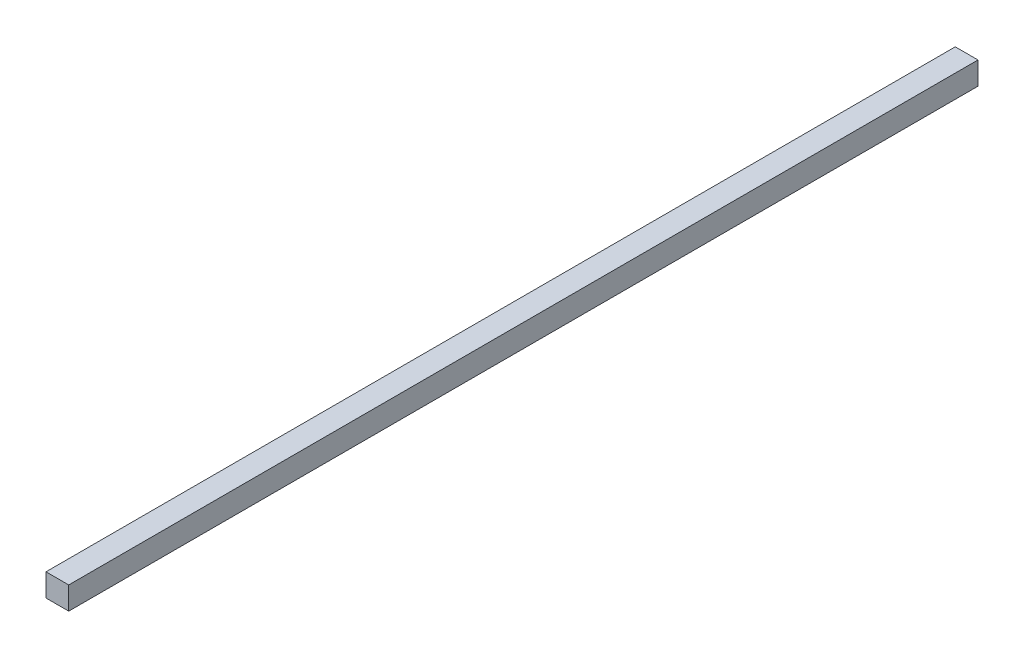
ISO-10303-21;
HEADER;
FILE_DESCRIPTION(('STEP AP214'),'2;1');
FILE_NAME('part.step','',(''),(''),'','','');
FILE_SCHEMA(('AUTOMOTIVE_DESIGN { 1 0 10303 214 1 1 1 1 }'));
ENDSEC;
DATA;
#1=APPLICATION_CONTEXT('core data for automotive mechanical design processes');
#2=APPLICATION_PROTOCOL_DEFINITION('international standard','automotive_design',2000,#1);
#3=PRODUCT_CONTEXT('',#1,'mechanical');
#4=PRODUCT('Part','Part','',(#3));
#5=PRODUCT_RELATED_PRODUCT_CATEGORY('part','',(#4));
#6=PRODUCT_DEFINITION_FORMATION('','',#4);
#7=PRODUCT_DEFINITION_CONTEXT('part definition',#1,'design');
#8=PRODUCT_DEFINITION('design','',#6,#7);
#9=PRODUCT_DEFINITION_SHAPE('','',#8);
#10=(LENGTH_UNIT() NAMED_UNIT(*) SI_UNIT(.MILLI.,.METRE.));
#11=(NAMED_UNIT(*) PLANE_ANGLE_UNIT() SI_UNIT($,.RADIAN.));
#12=(NAMED_UNIT(*) SI_UNIT($,.STERADIAN.) SOLID_ANGLE_UNIT());
#13=UNCERTAINTY_MEASURE_WITH_UNIT(LENGTH_MEASURE(1.E-05),#10,'distance_accuracy_value','');
#14=(GEOMETRIC_REPRESENTATION_CONTEXT(3) GLOBAL_UNCERTAINTY_ASSIGNED_CONTEXT((#13)) GLOBAL_UNIT_ASSIGNED_CONTEXT((#10,
#11,#12)) REPRESENTATION_CONTEXT('',''));
#15=CARTESIAN_POINT('',(0.,0.,0.));
#16=DIRECTION('',(0.,0.,1.));
#17=DIRECTION('',(1.,0.,0.));
#18=AXIS2_PLACEMENT_3D('',#15,#16,#17);
#19=CARTESIAN_POINT('',(10.,-10.,800.));
#20=DIRECTION('',(-1.,0.,0.));
#21=DIRECTION('',(0.,0.,1.));
#22=AXIS2_PLACEMENT_3D('',#19,#20,#21);
#23=PLANE('',#22);
#24=DIRECTION('',(0.,1.,0.));
#25=VECTOR('',#24,1.);
#26=CARTESIAN_POINT('',(10.,-10.,0.));
#27=LINE('',#26,#25);
#28=CARTESIAN_POINT('',(10.,-10.,0.));
#29=VERTEX_POINT('',#28);
#30=CARTESIAN_POINT('',(10.,10.,0.));
#31=VERTEX_POINT('',#30);
#32=EDGE_CURVE('E98',#29,#31,#27,.T.);
#33=ORIENTED_EDGE('',*,*,#32,.T.);
#34=DIRECTION('',(0.,0.,-1.));
#35=VECTOR('',#34,1.);
#36=CARTESIAN_POINT('',(10.,10.,800.));
#37=LINE('',#36,#35);
#38=CARTESIAN_POINT('',(10.,10.,800.));
#39=VERTEX_POINT('',#38);
#40=EDGE_CURVE('E11',#39,#31,#37,.T.);
#41=ORIENTED_EDGE('',*,*,#40,.F.);
#42=DIRECTION('',(0.,1.,0.));
#43=VECTOR('',#42,1.);
#44=CARTESIAN_POINT('',(10.,-10.,800.));
#45=LINE('',#44,#43);
#46=CARTESIAN_POINT('',(10.,-10.,800.));
#47=VERTEX_POINT('',#46);
#48=EDGE_CURVE('E86',#47,#39,#45,.T.);
#49=ORIENTED_EDGE('',*,*,#48,.F.);
#50=DIRECTION('',(0.,0.,-1.));
#51=VECTOR('',#50,1.);
#52=CARTESIAN_POINT('',(10.,-10.,800.));
#53=LINE('',#52,#51);
#54=EDGE_CURVE('E94',#47,#29,#53,.T.);
#55=ORIENTED_EDGE('',*,*,#54,.T.);
#56=EDGE_LOOP('',(#33,#41,#49,#55));
#57=FACE_BOUND('',#56,.T.);
#58=ADVANCED_FACE('F35',(#57),#23,.F.);
#59=CARTESIAN_POINT('',(-10.,10.,800.));
#60=DIRECTION('',(0.,-1.,0.));
#61=DIRECTION('',(0.,0.,-1.));
#62=AXIS2_PLACEMENT_3D('',#59,#60,#61);
#63=PLANE('',#62);
#64=DIRECTION('',(-1.,0.,0.));
#65=VECTOR('',#64,1.);
#66=CARTESIAN_POINT('',(-10.,10.,0.));
#67=LINE('',#66,#65);
#68=CARTESIAN_POINT('',(-10.,10.,0.));
#69=VERTEX_POINT('',#68);
#70=EDGE_CURVE('E90',#31,#69,#67,.T.);
#71=ORIENTED_EDGE('',*,*,#70,.T.);
#72=DIRECTION('',(0.,0.,-1.));
#73=VECTOR('',#72,1.);
#74=CARTESIAN_POINT('',(-10.,10.,800.));
#75=LINE('',#74,#73);
#76=CARTESIAN_POINT('',(-10.,10.,800.));
#77=VERTEX_POINT('',#76);
#78=EDGE_CURVE('E43',#77,#69,#75,.T.);
#79=ORIENTED_EDGE('',*,*,#78,.F.);
#80=DIRECTION('',(-1.,0.,0.));
#81=VECTOR('',#80,1.);
#82=CARTESIAN_POINT('',(-10.,10.,800.));
#83=LINE('',#82,#81);
#84=EDGE_CURVE('E81',#39,#77,#83,.T.);
#85=ORIENTED_EDGE('',*,*,#84,.F.);
#86=ORIENTED_EDGE('',*,*,#40,.T.);
#87=EDGE_LOOP('',(#71,#79,#85,#86));
#88=FACE_BOUND('',#87,.T.);
#89=ADVANCED_FACE('F89',(#88),#63,.F.);
#90=CARTESIAN_POINT('',(-10.,-10.,800.));
#91=DIRECTION('',(1.,0.,0.));
#92=DIRECTION('',(0.,0.,-1.));
#93=AXIS2_PLACEMENT_3D('',#90,#91,#92);
#94=PLANE('',#93);
#95=DIRECTION('',(0.,-1.,0.));
#96=VECTOR('',#95,1.);
#97=CARTESIAN_POINT('',(-10.,-10.,0.));
#98=LINE('',#97,#96);
#99=CARTESIAN_POINT('',(-10.,-10.,0.));
#100=VERTEX_POINT('',#99);
#101=EDGE_CURVE('E68',#69,#100,#98,.T.);
#102=ORIENTED_EDGE('',*,*,#101,.T.);
#103=DIRECTION('',(0.,0.,-1.));
#104=VECTOR('',#103,1.);
#105=CARTESIAN_POINT('',(-10.,-10.,800.));
#106=LINE('',#105,#104);
#107=CARTESIAN_POINT('',(-10.,-10.,800.));
#108=VERTEX_POINT('',#107);
#109=EDGE_CURVE('E91',#108,#100,#106,.T.);
#110=ORIENTED_EDGE('',*,*,#109,.F.);
#111=DIRECTION('',(0.,-1.,0.));
#112=VECTOR('',#111,1.);
#113=CARTESIAN_POINT('',(-10.,-10.,800.));
#114=LINE('',#113,#112);
#115=EDGE_CURVE('E84',#77,#108,#114,.T.);
#116=ORIENTED_EDGE('',*,*,#115,.F.);
#117=ORIENTED_EDGE('',*,*,#78,.T.);
#118=EDGE_LOOP('',(#102,#110,#116,#117));
#119=FACE_BOUND('',#118,.T.);
#120=ADVANCED_FACE('F92',(#119),#94,.F.);
#121=CARTESIAN_POINT('',(-10.,-10.,800.));
#122=DIRECTION('',(0.,1.,0.));
#123=DIRECTION('',(0.,0.,1.));
#124=AXIS2_PLACEMENT_3D('',#121,#122,#123);
#125=PLANE('',#124);
#126=DIRECTION('',(1.,0.,0.));
#127=VECTOR('',#126,1.);
#128=CARTESIAN_POINT('',(-10.,-10.,0.));
#129=LINE('',#128,#127);
#130=EDGE_CURVE('E74',#100,#29,#129,.T.);
#131=ORIENTED_EDGE('',*,*,#130,.T.);
#132=ORIENTED_EDGE('',*,*,#54,.F.);
#133=DIRECTION('',(1.,0.,0.));
#134=VECTOR('',#133,1.);
#135=CARTESIAN_POINT('',(-10.,-10.,800.));
#136=LINE('',#135,#134);
#137=EDGE_CURVE('E51',#108,#47,#136,.T.);
#138=ORIENTED_EDGE('',*,*,#137,.F.);
#139=ORIENTED_EDGE('',*,*,#109,.T.);
#140=EDGE_LOOP('',(#131,#132,#138,#139));
#141=FACE_BOUND('',#140,.T.);
#142=ADVANCED_FACE('F105',(#141),#125,.F.);
#143=CARTESIAN_POINT('',(0.,0.,800.));
#144=DIRECTION('',(0.,0.,-1.));
#145=DIRECTION('',(-1.,0.,0.));
#146=AXIS2_PLACEMENT_3D('',#143,#144,#145);
#147=PLANE('',#146);
#148=ORIENTED_EDGE('',*,*,#48,.T.);
#149=ORIENTED_EDGE('',*,*,#84,.T.);
#150=ORIENTED_EDGE('',*,*,#115,.T.);
#151=ORIENTED_EDGE('',*,*,#137,.T.);
#152=EDGE_LOOP('',(#148,#149,#150,#151));
#153=FACE_BOUND('',#152,.T.);
#154=ADVANCED_FACE('F82',(#153),#147,.F.);
#155=CARTESIAN_POINT('',(0.,0.,0.));
#156=DIRECTION('',(0.,0.,-1.));
#157=DIRECTION('',(-1.,0.,0.));
#158=AXIS2_PLACEMENT_3D('',#155,#156,#157);
#159=PLANE('',#158);
#160=ORIENTED_EDGE('',*,*,#32,.F.);
#161=ORIENTED_EDGE('',*,*,#130,.F.);
#162=ORIENTED_EDGE('',*,*,#101,.F.);
#163=ORIENTED_EDGE('',*,*,#70,.F.);
#164=EDGE_LOOP('',(#160,#161,#162,#163));
#165=FACE_BOUND('',#164,.T.);
#166=ADVANCED_FACE('F108',(#165),#159,.T.);
#167=CLOSED_SHELL('',(#58,#89,#120,#142,#154,#166));
#168=MANIFOLD_SOLID_BREP('B2',#167);
#169=ADVANCED_BREP_SHAPE_REPRESENTATION('',(#18,#168),#14);
#170=SHAPE_DEFINITION_REPRESENTATION(#9,#169);
ENDSEC;
END-ISO-10303-21;
